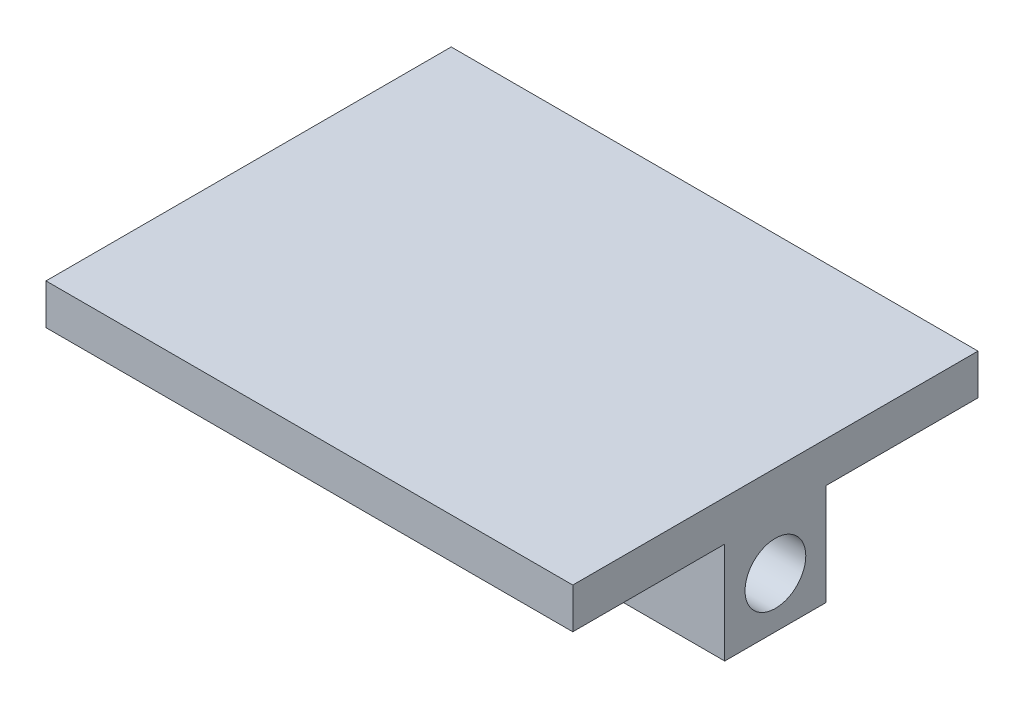
ISO-10303-21;
HEADER;
FILE_DESCRIPTION(('STEP AP214'),'2;1');
FILE_NAME('part.step','',(''),(''),'','','');
FILE_SCHEMA(('AUTOMOTIVE_DESIGN { 1 0 10303 214 1 1 1 1 }'));
ENDSEC;
DATA;
#1=APPLICATION_CONTEXT('core data for automotive mechanical design processes');
#2=APPLICATION_PROTOCOL_DEFINITION('international standard','automotive_design',2000,#1);
#3=PRODUCT_CONTEXT('',#1,'mechanical');
#4=PRODUCT('Part','Part','',(#3));
#5=PRODUCT_RELATED_PRODUCT_CATEGORY('part','',(#4));
#6=PRODUCT_DEFINITION_FORMATION('','',#4);
#7=PRODUCT_DEFINITION_CONTEXT('part definition',#1,'design');
#8=PRODUCT_DEFINITION('design','',#6,#7);
#9=PRODUCT_DEFINITION_SHAPE('','',#8);
#10=(LENGTH_UNIT() NAMED_UNIT(*) SI_UNIT(.MILLI.,.METRE.));
#11=(NAMED_UNIT(*) PLANE_ANGLE_UNIT() SI_UNIT($,.RADIAN.));
#12=(NAMED_UNIT(*) SI_UNIT($,.STERADIAN.) SOLID_ANGLE_UNIT());
#13=UNCERTAINTY_MEASURE_WITH_UNIT(LENGTH_MEASURE(1.E-05),#10,'distance_accuracy_value','');
#14=(GEOMETRIC_REPRESENTATION_CONTEXT(3) GLOBAL_UNCERTAINTY_ASSIGNED_CONTEXT((#13)) GLOBAL_UNIT_ASSIGNED_CONTEXT((#10,
#11,#12)) REPRESENTATION_CONTEXT('',''));
#15=CARTESIAN_POINT('',(0.,0.,0.));
#16=DIRECTION('',(0.,0.,1.));
#17=DIRECTION('',(1.,0.,0.));
#18=AXIS2_PLACEMENT_3D('',#15,#16,#17);
#19=CARTESIAN_POINT('',(0.,-6.35,0.));
#20=DIRECTION('',(0.,1.,0.));
#21=DIRECTION('',(0.,0.,1.));
#22=AXIS2_PLACEMENT_3D('',#19,#20,#21);
#23=PLANE('',#22);
#24=DIRECTION('',(1.,0.,0.));
#25=VECTOR('',#24,1.);
#26=CARTESIAN_POINT('',(-82.55,-6.35,-15.875));
#27=LINE('',#26,#25);
#28=CARTESIAN_POINT('',(-82.55,-6.35,-15.875));
#29=VERTEX_POINT('',#28);
#30=CARTESIAN_POINT('',(82.55,-6.35,-15.875));
#31=VERTEX_POINT('',#30);
#32=EDGE_CURVE('E49',#29,#31,#27,.T.);
#33=ORIENTED_EDGE('',*,*,#32,.F.);
#34=DIRECTION('',(0.,0.,1.));
#35=VECTOR('',#34,1.);
#36=CARTESIAN_POINT('',(-82.55,-6.35,-63.5));
#37=LINE('',#36,#35);
#38=CARTESIAN_POINT('',(-82.55,-6.35,-63.5));
#39=VERTEX_POINT('',#38);
#40=EDGE_CURVE('E167',#39,#29,#37,.T.);
#41=ORIENTED_EDGE('',*,*,#40,.F.);
#42=DIRECTION('',(-1.,0.,0.));
#43=VECTOR('',#42,1.);
#44=CARTESIAN_POINT('',(-82.55,-6.35,-63.5));
#45=LINE('',#44,#43);
#46=CARTESIAN_POINT('',(82.55,-6.35,-63.5));
#47=VERTEX_POINT('',#46);
#48=EDGE_CURVE('E155',#47,#39,#45,.T.);
#49=ORIENTED_EDGE('',*,*,#48,.F.);
#50=DIRECTION('',(0.,0.,-1.));
#51=VECTOR('',#50,1.);
#52=CARTESIAN_POINT('',(82.55,-6.35,-63.5));
#53=LINE('',#52,#51);
#54=EDGE_CURVE('E54',#31,#47,#53,.T.);
#55=ORIENTED_EDGE('',*,*,#54,.F.);
#56=EDGE_LOOP('',(#33,#41,#49,#55));
#57=FACE_BOUND('',#56,.T.);
#58=ADVANCED_FACE('F32',(#57),#23,.F.);
#59=DIRECTION('',(-1.,0.,0.));
#60=VECTOR('',#59,1.);
#61=CARTESIAN_POINT('',(-82.55,-6.35,15.875));
#62=LINE('',#61,#60);
#63=CARTESIAN_POINT('',(82.55,-6.35,15.875));
#64=VERTEX_POINT('',#63);
#65=CARTESIAN_POINT('',(-82.55,-6.35,15.875));
#66=VERTEX_POINT('',#65);
#67=EDGE_CURVE('E134',#64,#66,#62,.T.);
#68=ORIENTED_EDGE('',*,*,#67,.F.);
#69=CARTESIAN_POINT('',(82.55,-6.35,63.5));
#70=VERTEX_POINT('',#69);
#71=EDGE_CURVE('E122',#70,#64,#53,.T.);
#72=ORIENTED_EDGE('',*,*,#71,.F.);
#73=DIRECTION('',(1.,0.,0.));
#74=VECTOR('',#73,1.);
#75=CARTESIAN_POINT('',(-82.55,-6.35,63.5));
#76=LINE('',#75,#74);
#77=CARTESIAN_POINT('',(-82.55,-6.35,63.5));
#78=VERTEX_POINT('',#77);
#79=EDGE_CURVE('E146',#78,#70,#76,.T.);
#80=ORIENTED_EDGE('',*,*,#79,.F.);
#81=EDGE_CURVE('E171',#66,#78,#37,.T.);
#82=ORIENTED_EDGE('',*,*,#81,.F.);
#83=EDGE_LOOP('',(#68,#72,#80,#82));
#84=FACE_BOUND('',#83,.T.);
#85=ADVANCED_FACE('F184',(#84),#23,.F.);
#86=CARTESIAN_POINT('',(82.55,6.35,-63.5));
#87=DIRECTION('',(-1.,0.,0.));
#88=DIRECTION('',(0.,0.,1.));
#89=AXIS2_PLACEMENT_3D('',#86,#87,#88);
#90=PLANE('',#89);
#91=CARTESIAN_POINT('',(82.55,-22.225,0.));
#92=DIRECTION('',(1.,0.,0.));
#93=DIRECTION('',(0.,0.,-1.));
#94=AXIS2_PLACEMENT_3D('',#91,#92,#93);
#95=CIRCLE('',#94,9.525);
#96=CARTESIAN_POINT('',(82.55,-22.225,-9.525));
#97=VERTEX_POINT('',#96);
#98=EDGE_CURVE('E209',#97,#97,#95,.T.);
#99=ORIENTED_EDGE('',*,*,#98,.F.);
#100=EDGE_LOOP('',(#99));
#101=FACE_BOUND('',#100,.T.);
#102=ORIENTED_EDGE('',*,*,#71,.T.);
#103=DIRECTION('',(0.,1.,0.));
#104=VECTOR('',#103,1.);
#105=CARTESIAN_POINT('',(82.55,-38.1,15.875));
#106=LINE('',#105,#104);
#107=CARTESIAN_POINT('',(82.55,-38.1,15.875));
#108=VERTEX_POINT('',#107);
#109=EDGE_CURVE('E103',#108,#64,#106,.T.);
#110=ORIENTED_EDGE('',*,*,#109,.F.);
#111=DIRECTION('',(0.,0.,1.));
#112=VECTOR('',#111,1.);
#113=CARTESIAN_POINT('',(82.55,-38.1,15.875));
#114=LINE('',#113,#112);
#115=CARTESIAN_POINT('',(82.55,-38.1,-15.875));
#116=VERTEX_POINT('',#115);
#117=EDGE_CURVE('E109',#116,#108,#114,.T.);
#118=ORIENTED_EDGE('',*,*,#117,.F.);
#119=DIRECTION('',(0.,1.,0.));
#120=VECTOR('',#119,1.);
#121=CARTESIAN_POINT('',(82.55,-38.1,-15.875));
#122=LINE('',#121,#120);
#123=EDGE_CURVE('E135',#116,#31,#122,.T.);
#124=ORIENTED_EDGE('',*,*,#123,.T.);
#125=ORIENTED_EDGE('',*,*,#54,.T.);
#126=DIRECTION('',(0.,-1.,0.));
#127=VECTOR('',#126,1.);
#128=CARTESIAN_POINT('',(82.55,6.35,-63.5));
#129=LINE('',#128,#127);
#130=CARTESIAN_POINT('',(82.55,6.35,-63.5));
#131=VERTEX_POINT('',#130);
#132=EDGE_CURVE('E11',#131,#47,#129,.T.);
#133=ORIENTED_EDGE('',*,*,#132,.F.);
#134=DIRECTION('',(0.,0.,-1.));
#135=VECTOR('',#134,1.);
#136=CARTESIAN_POINT('',(82.55,6.35,-63.5));
#137=LINE('',#136,#135);
#138=CARTESIAN_POINT('',(82.55,6.35,63.5));
#139=VERTEX_POINT('',#138);
#140=EDGE_CURVE('E142',#139,#131,#137,.T.);
#141=ORIENTED_EDGE('',*,*,#140,.F.);
#142=DIRECTION('',(0.,-1.,0.));
#143=VECTOR('',#142,1.);
#144=CARTESIAN_POINT('',(82.55,6.35,63.5));
#145=LINE('',#144,#143);
#146=EDGE_CURVE('E152',#139,#70,#145,.T.);
#147=ORIENTED_EDGE('',*,*,#146,.T.);
#148=EDGE_LOOP('',(#102,#110,#118,#124,#125,#133,#141,#147));
#149=FACE_BOUND('',#148,.T.);
#150=ADVANCED_FACE('F34',(#101,#149),#90,.F.);
#151=CARTESIAN_POINT('',(-82.55,6.35,-63.5));
#152=DIRECTION('',(0.,0.,1.));
#153=DIRECTION('',(1.,0.,0.));
#154=AXIS2_PLACEMENT_3D('',#151,#152,#153);
#155=PLANE('',#154);
#156=ORIENTED_EDGE('',*,*,#48,.T.);
#157=DIRECTION('',(0.,-1.,0.));
#158=VECTOR('',#157,1.);
#159=CARTESIAN_POINT('',(-82.55,6.35,-63.5));
#160=LINE('',#159,#158);
#161=CARTESIAN_POINT('',(-82.55,6.35,-63.5));
#162=VERTEX_POINT('',#161);
#163=EDGE_CURVE('E41',#162,#39,#160,.T.);
#164=ORIENTED_EDGE('',*,*,#163,.F.);
#165=DIRECTION('',(-1.,0.,0.));
#166=VECTOR('',#165,1.);
#167=CARTESIAN_POINT('',(-82.55,6.35,-63.5));
#168=LINE('',#167,#166);
#169=EDGE_CURVE('E145',#131,#162,#168,.T.);
#170=ORIENTED_EDGE('',*,*,#169,.F.);
#171=ORIENTED_EDGE('',*,*,#132,.T.);
#172=EDGE_LOOP('',(#156,#164,#170,#171));
#173=FACE_BOUND('',#172,.T.);
#174=ADVANCED_FACE('F179',(#173),#155,.F.);
#175=CARTESIAN_POINT('',(-82.55,6.35,-63.5));
#176=DIRECTION('',(1.,0.,0.));
#177=DIRECTION('',(0.,0.,-1.));
#178=AXIS2_PLACEMENT_3D('',#175,#176,#177);
#179=PLANE('',#178);
#180=CARTESIAN_POINT('',(-82.55,-22.225,0.));
#181=DIRECTION('',(1.,0.,0.));
#182=DIRECTION('',(0.,0.,-1.));
#183=AXIS2_PLACEMENT_3D('',#180,#181,#182);
#184=CIRCLE('',#183,9.525);
#185=CARTESIAN_POINT('',(-82.55,-22.225,-9.52499999999996));
#186=VERTEX_POINT('',#185);
#187=EDGE_CURVE('E211',#186,#186,#184,.F.);
#188=ORIENTED_EDGE('',*,*,#187,.F.);
#189=EDGE_LOOP('',(#188));
#190=FACE_BOUND('',#189,.T.);
#191=ORIENTED_EDGE('',*,*,#40,.T.);
#192=DIRECTION('',(0.,1.,0.));
#193=VECTOR('',#192,1.);
#194=CARTESIAN_POINT('',(-82.55,-38.1,-15.875));
#195=LINE('',#194,#193);
#196=CARTESIAN_POINT('',(-82.55,-38.1,-15.875));
#197=VERTEX_POINT('',#196);
#198=EDGE_CURVE('E125',#197,#29,#195,.T.);
#199=ORIENTED_EDGE('',*,*,#198,.F.);
#200=DIRECTION('',(0.,0.,-1.));
#201=VECTOR('',#200,1.);
#202=CARTESIAN_POINT('',(-82.55,-38.1,15.875));
#203=LINE('',#202,#201);
#204=CARTESIAN_POINT('',(-82.55,-38.1,15.875));
#205=VERTEX_POINT('',#204);
#206=EDGE_CURVE('E108',#205,#197,#203,.T.);
#207=ORIENTED_EDGE('',*,*,#206,.F.);
#208=DIRECTION('',(0.,1.,0.));
#209=VECTOR('',#208,1.);
#210=CARTESIAN_POINT('',(-82.55,-38.1,15.875));
#211=LINE('',#210,#209);
#212=EDGE_CURVE('E105',#205,#66,#211,.T.);
#213=ORIENTED_EDGE('',*,*,#212,.T.);
#214=ORIENTED_EDGE('',*,*,#81,.T.);
#215=DIRECTION('',(0.,-1.,0.));
#216=VECTOR('',#215,1.);
#217=CARTESIAN_POINT('',(-82.55,6.35,63.5));
#218=LINE('',#217,#216);
#219=CARTESIAN_POINT('',(-82.55,6.35,63.5));
#220=VERTEX_POINT('',#219);
#221=EDGE_CURVE('E163',#220,#78,#218,.T.);
#222=ORIENTED_EDGE('',*,*,#221,.F.);
#223=DIRECTION('',(0.,0.,1.));
#224=VECTOR('',#223,1.);
#225=CARTESIAN_POINT('',(-82.55,6.35,-63.5));
#226=LINE('',#225,#224);
#227=EDGE_CURVE('E148',#162,#220,#226,.T.);
#228=ORIENTED_EDGE('',*,*,#227,.F.);
#229=ORIENTED_EDGE('',*,*,#163,.T.);
#230=EDGE_LOOP('',(#191,#199,#207,#213,#214,#222,#228,#229));
#231=FACE_BOUND('',#230,.T.);
#232=ADVANCED_FACE('F182',(#190,#231),#179,.F.);
#233=CARTESIAN_POINT('',(-82.55,6.35,63.5));
#234=DIRECTION('',(0.,0.,-1.));
#235=DIRECTION('',(-1.,0.,0.));
#236=AXIS2_PLACEMENT_3D('',#233,#234,#235);
#237=PLANE('',#236);
#238=ORIENTED_EDGE('',*,*,#79,.T.);
#239=ORIENTED_EDGE('',*,*,#146,.F.);
#240=DIRECTION('',(1.,0.,0.));
#241=VECTOR('',#240,1.);
#242=CARTESIAN_POINT('',(-82.55,6.35,63.5));
#243=LINE('',#242,#241);
#244=EDGE_CURVE('E150',#220,#139,#243,.T.);
#245=ORIENTED_EDGE('',*,*,#244,.F.);
#246=ORIENTED_EDGE('',*,*,#221,.T.);
#247=EDGE_LOOP('',(#238,#239,#245,#246));
#248=FACE_BOUND('',#247,.T.);
#249=ADVANCED_FACE('F194',(#248),#237,.F.);
#250=CARTESIAN_POINT('',(0.,6.35,0.));
#251=DIRECTION('',(0.,1.,0.));
#252=DIRECTION('',(0.,0.,1.));
#253=AXIS2_PLACEMENT_3D('',#250,#251,#252);
#254=PLANE('',#253);
#255=ORIENTED_EDGE('',*,*,#140,.T.);
#256=ORIENTED_EDGE('',*,*,#169,.T.);
#257=ORIENTED_EDGE('',*,*,#227,.T.);
#258=ORIENTED_EDGE('',*,*,#244,.T.);
#259=EDGE_LOOP('',(#255,#256,#257,#258));
#260=FACE_BOUND('',#259,.T.);
#261=ADVANCED_FACE('F192',(#260),#254,.T.);
#262=CARTESIAN_POINT('',(-82.55,-38.1,15.875));
#263=DIRECTION('',(0.,0.,-1.));
#264=DIRECTION('',(-1.,0.,0.));
#265=AXIS2_PLACEMENT_3D('',#262,#263,#264);
#266=PLANE('',#265);
#267=ORIENTED_EDGE('',*,*,#67,.T.);
#268=ORIENTED_EDGE('',*,*,#212,.F.);
#269=DIRECTION('',(-1.,0.,0.));
#270=VECTOR('',#269,1.);
#271=CARTESIAN_POINT('',(-82.55,-38.1,15.875));
#272=LINE('',#271,#270);
#273=EDGE_CURVE('E98',#108,#205,#272,.T.);
#274=ORIENTED_EDGE('',*,*,#273,.F.);
#275=ORIENTED_EDGE('',*,*,#109,.T.);
#276=EDGE_LOOP('',(#267,#268,#274,#275));
#277=FACE_BOUND('',#276,.T.);
#278=ADVANCED_FACE('F101',(#277),#266,.F.);
#279=CARTESIAN_POINT('',(-82.55,-38.1,-15.875));
#280=DIRECTION('',(0.,0.,1.));
#281=DIRECTION('',(1.,0.,0.));
#282=AXIS2_PLACEMENT_3D('',#279,#280,#281);
#283=PLANE('',#282);
#284=ORIENTED_EDGE('',*,*,#32,.T.);
#285=ORIENTED_EDGE('',*,*,#123,.F.);
#286=DIRECTION('',(1.,0.,0.));
#287=VECTOR('',#286,1.);
#288=CARTESIAN_POINT('',(-82.55,-38.1,-15.875));
#289=LINE('',#288,#287);
#290=EDGE_CURVE('E114',#197,#116,#289,.T.);
#291=ORIENTED_EDGE('',*,*,#290,.F.);
#292=ORIENTED_EDGE('',*,*,#198,.T.);
#293=EDGE_LOOP('',(#284,#285,#291,#292));
#294=FACE_BOUND('',#293,.T.);
#295=ADVANCED_FACE('F218',(#294),#283,.F.);
#296=CARTESIAN_POINT('',(0.,-38.1,0.));
#297=DIRECTION('',(0.,-1.,0.));
#298=DIRECTION('',(0.,0.,-1.));
#299=AXIS2_PLACEMENT_3D('',#296,#297,#298);
#300=PLANE('',#299);
#301=ORIENTED_EDGE('',*,*,#117,.T.);
#302=ORIENTED_EDGE('',*,*,#273,.T.);
#303=ORIENTED_EDGE('',*,*,#206,.T.);
#304=ORIENTED_EDGE('',*,*,#290,.T.);
#305=EDGE_LOOP('',(#301,#302,#303,#304));
#306=FACE_BOUND('',#305,.T.);
#307=ADVANCED_FACE('F112',(#306),#300,.T.);
#308=CARTESIAN_POINT('',(-82.5510500000001,-22.225,0.));
#309=DIRECTION('',(1.,0.,0.));
#310=DIRECTION('',(0.,0.,-1.));
#311=AXIS2_PLACEMENT_3D('',#308,#309,#310);
#312=CYLINDRICAL_SURFACE('',#311,9.525);
#313=ORIENTED_EDGE('',*,*,#98,.T.);
#314=EDGE_LOOP('',(#313));
#315=FACE_BOUND('',#314,.T.);
#316=ORIENTED_EDGE('',*,*,#187,.T.);
#317=EDGE_LOOP('',(#316));
#318=FACE_BOUND('',#317,.T.);
#319=ADVANCED_FACE('F225',(#315,#318),#312,.F.);
#320=CLOSED_SHELL('',(#58,#85,#150,#174,#232,#249,#261,#278,#295,#307,#319));
#321=MANIFOLD_SOLID_BREP('B2',#320);
#322=ADVANCED_BREP_SHAPE_REPRESENTATION('',(#18,#321),#14);
#323=SHAPE_DEFINITION_REPRESENTATION(#9,#322);
ENDSEC;
END-ISO-10303-21;
